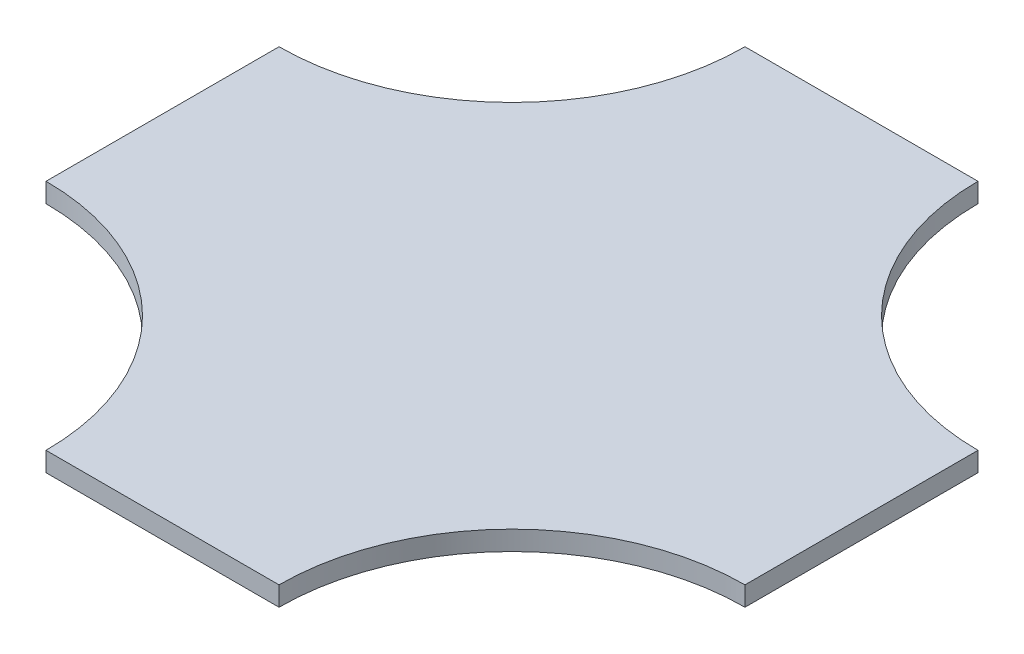
ISO-10303-21;
HEADER;
FILE_DESCRIPTION(('STEP AP214'),'2;1');
FILE_NAME('part.step','',(''),(''),'','','');
FILE_SCHEMA(('AUTOMOTIVE_DESIGN { 1 0 10303 214 1 1 1 1 }'));
ENDSEC;
DATA;
#1=APPLICATION_CONTEXT('core data for automotive mechanical design processes');
#2=APPLICATION_PROTOCOL_DEFINITION('international standard','automotive_design',2000,#1);
#3=PRODUCT_CONTEXT('',#1,'mechanical');
#4=PRODUCT('Part','Part','',(#3));
#5=PRODUCT_RELATED_PRODUCT_CATEGORY('part','',(#4));
#6=PRODUCT_DEFINITION_FORMATION('','',#4);
#7=PRODUCT_DEFINITION_CONTEXT('part definition',#1,'design');
#8=PRODUCT_DEFINITION('design','',#6,#7);
#9=PRODUCT_DEFINITION_SHAPE('','',#8);
#10=(LENGTH_UNIT() NAMED_UNIT(*) SI_UNIT(.MILLI.,.METRE.));
#11=(NAMED_UNIT(*) PLANE_ANGLE_UNIT() SI_UNIT($,.RADIAN.));
#12=(NAMED_UNIT(*) SI_UNIT($,.STERADIAN.) SOLID_ANGLE_UNIT());
#13=UNCERTAINTY_MEASURE_WITH_UNIT(LENGTH_MEASURE(1.E-05),#10,'distance_accuracy_value','');
#14=(GEOMETRIC_REPRESENTATION_CONTEXT(3) GLOBAL_UNCERTAINTY_ASSIGNED_CONTEXT((#13)) GLOBAL_UNIT_ASSIGNED_CONTEXT((#10,
#11,#12)) REPRESENTATION_CONTEXT('',''));
#15=CARTESIAN_POINT('',(0.,0.,0.));
#16=DIRECTION('',(0.,0.,1.));
#17=DIRECTION('',(1.,0.,0.));
#18=AXIS2_PLACEMENT_3D('',#15,#16,#17);
#19=CARTESIAN_POINT('',(0.,10.,180.));
#20=DIRECTION('',(0.,0.,1.));
#21=DIRECTION('',(1.,0.,0.));
#22=AXIS2_PLACEMENT_3D('',#19,#20,#21);
#23=PLANE('',#22);
#24=DIRECTION('',(-1.,0.,0.));
#25=VECTOR('',#24,1.);
#26=CARTESIAN_POINT('',(0.,0.,180.));
#27=LINE('',#26,#25);
#28=CARTESIAN_POINT('',(60.,0.,180.));
#29=VERTEX_POINT('',#28);
#30=CARTESIAN_POINT('',(-59.9999999999999,0.,180.));
#31=VERTEX_POINT('',#30);
#32=EDGE_CURVE('E127',#29,#31,#27,.T.);
#33=ORIENTED_EDGE('',*,*,#32,.F.);
#34=DIRECTION('',(0.,-1.,0.));
#35=VECTOR('',#34,1.);
#36=CARTESIAN_POINT('',(60.,10.,180.));
#37=LINE('',#36,#35);
#38=CARTESIAN_POINT('',(60.,10.,180.));
#39=VERTEX_POINT('',#38);
#40=EDGE_CURVE('E11',#39,#29,#37,.T.);
#41=ORIENTED_EDGE('',*,*,#40,.F.);
#42=DIRECTION('',(-1.,0.,0.));
#43=VECTOR('',#42,1.);
#44=CARTESIAN_POINT('',(0.,10.,180.));
#45=LINE('',#44,#43);
#46=CARTESIAN_POINT('',(-59.9999999999999,10.,180.));
#47=VERTEX_POINT('',#46);
#48=EDGE_CURVE('E145',#39,#47,#45,.T.);
#49=ORIENTED_EDGE('',*,*,#48,.T.);
#50=DIRECTION('',(0.,-1.,0.));
#51=VECTOR('',#50,1.);
#52=CARTESIAN_POINT('',(-59.9999999999999,10.,180.));
#53=LINE('',#52,#51);
#54=EDGE_CURVE('E85',#47,#31,#53,.T.);
#55=ORIENTED_EDGE('',*,*,#54,.T.);
#56=EDGE_LOOP('',(#33,#41,#49,#55));
#57=FACE_BOUND('',#56,.T.);
#58=ADVANCED_FACE('F34',(#57),#23,.T.);
#59=CARTESIAN_POINT('',(180.,10.,180.));
#60=DIRECTION('',(0.,-1.,0.));
#61=DIRECTION('',(0.,0.,-1.));
#62=AXIS2_PLACEMENT_3D('',#59,#60,#61);
#63=CYLINDRICAL_SURFACE('',#62,120.);
#64=CARTESIAN_POINT('',(180.,0.,180.));
#65=DIRECTION('',(0.,1.,0.));
#66=DIRECTION('',(0.,0.,1.));
#67=AXIS2_PLACEMENT_3D('',#64,#65,#66);
#68=CIRCLE('',#67,120.);
#69=CARTESIAN_POINT('',(180.,0.,60.0000000000001));
#70=VERTEX_POINT('',#69);
#71=EDGE_CURVE('E130',#70,#29,#68,.T.);
#72=ORIENTED_EDGE('',*,*,#71,.F.);
#73=DIRECTION('',(0.,-1.,0.));
#74=VECTOR('',#73,1.);
#75=CARTESIAN_POINT('',(180.,10.,60.0000000000001));
#76=LINE('',#75,#74);
#77=CARTESIAN_POINT('',(180.,10.,60.0000000000001));
#78=VERTEX_POINT('',#77);
#79=EDGE_CURVE('E42',#78,#70,#76,.T.);
#80=ORIENTED_EDGE('',*,*,#79,.F.);
#81=CARTESIAN_POINT('',(180.,10.,180.));
#82=DIRECTION('',(0.,1.,0.));
#83=DIRECTION('',(0.,0.,1.));
#84=AXIS2_PLACEMENT_3D('',#81,#82,#83);
#85=CIRCLE('',#84,120.);
#86=EDGE_CURVE('E171',#78,#39,#85,.T.);
#87=ORIENTED_EDGE('',*,*,#86,.T.);
#88=ORIENTED_EDGE('',*,*,#40,.T.);
#89=EDGE_LOOP('',(#72,#80,#87,#88));
#90=FACE_BOUND('',#89,.T.);
#91=ADVANCED_FACE('F162',(#90),#63,.F.);
#92=CARTESIAN_POINT('',(180.,10.,0.));
#93=DIRECTION('',(1.,0.,0.));
#94=DIRECTION('',(0.,0.,-1.));
#95=AXIS2_PLACEMENT_3D('',#92,#93,#94);
#96=PLANE('',#95);
#97=DIRECTION('',(0.,0.,1.));
#98=VECTOR('',#97,1.);
#99=CARTESIAN_POINT('',(180.,0.,0.));
#100=LINE('',#99,#98);
#101=CARTESIAN_POINT('',(180.,0.,-59.9999999999998));
#102=VERTEX_POINT('',#101);
#103=EDGE_CURVE('E133',#102,#70,#100,.T.);
#104=ORIENTED_EDGE('',*,*,#103,.F.);
#105=DIRECTION('',(0.,-1.,0.));
#106=VECTOR('',#105,1.);
#107=CARTESIAN_POINT('',(180.,10.,-59.9999999999998));
#108=LINE('',#107,#106);
#109=CARTESIAN_POINT('',(180.,10.,-59.9999999999998));
#110=VERTEX_POINT('',#109);
#111=EDGE_CURVE('E151',#110,#102,#108,.T.);
#112=ORIENTED_EDGE('',*,*,#111,.F.);
#113=DIRECTION('',(0.,0.,1.));
#114=VECTOR('',#113,1.);
#115=CARTESIAN_POINT('',(180.,10.,0.));
#116=LINE('',#115,#114);
#117=EDGE_CURVE('E158',#110,#78,#116,.T.);
#118=ORIENTED_EDGE('',*,*,#117,.T.);
#119=ORIENTED_EDGE('',*,*,#79,.T.);
#120=EDGE_LOOP('',(#104,#112,#118,#119));
#121=FACE_BOUND('',#120,.T.);
#122=ADVANCED_FACE('F156',(#121),#96,.T.);
#123=CARTESIAN_POINT('',(180.,10.,-180.));
#124=DIRECTION('',(0.,-1.,0.));
#125=DIRECTION('',(0.,0.,-1.));
#126=AXIS2_PLACEMENT_3D('',#123,#124,#125);
#127=CYLINDRICAL_SURFACE('',#126,120.);
#128=CARTESIAN_POINT('',(180.,0.,-180.));
#129=DIRECTION('',(0.,1.,0.));
#130=DIRECTION('',(0.,0.,1.));
#131=AXIS2_PLACEMENT_3D('',#128,#129,#130);
#132=CIRCLE('',#131,120.);
#133=CARTESIAN_POINT('',(60.,0.,-180.));
#134=VERTEX_POINT('',#133);
#135=EDGE_CURVE('E136',#134,#102,#132,.T.);
#136=ORIENTED_EDGE('',*,*,#135,.F.);
#137=DIRECTION('',(0.,-1.,0.));
#138=VECTOR('',#137,1.);
#139=CARTESIAN_POINT('',(60.,10.,-180.));
#140=LINE('',#139,#138);
#141=CARTESIAN_POINT('',(60.,10.,-180.));
#142=VERTEX_POINT('',#141);
#143=EDGE_CURVE('E149',#142,#134,#140,.T.);
#144=ORIENTED_EDGE('',*,*,#143,.F.);
#145=CARTESIAN_POINT('',(180.,10.,-180.));
#146=DIRECTION('',(0.,1.,0.));
#147=DIRECTION('',(0.,0.,1.));
#148=AXIS2_PLACEMENT_3D('',#145,#146,#147);
#149=CIRCLE('',#148,120.);
#150=EDGE_CURVE('E170',#142,#110,#149,.T.);
#151=ORIENTED_EDGE('',*,*,#150,.T.);
#152=ORIENTED_EDGE('',*,*,#111,.T.);
#153=EDGE_LOOP('',(#136,#144,#151,#152));
#154=FACE_BOUND('',#153,.T.);
#155=ADVANCED_FACE('F168',(#154),#127,.F.);
#156=CARTESIAN_POINT('',(0.,10.,-180.));
#157=DIRECTION('',(0.,0.,1.));
#158=DIRECTION('',(1.,0.,0.));
#159=AXIS2_PLACEMENT_3D('',#156,#157,#158);
#160=PLANE('',#159);
#161=DIRECTION('',(-1.,0.,0.));
#162=VECTOR('',#161,1.);
#163=CARTESIAN_POINT('',(0.,0.,-180.));
#164=LINE('',#163,#162);
#165=CARTESIAN_POINT('',(-59.9999999999999,0.,-180.));
#166=VERTEX_POINT('',#165);
#167=EDGE_CURVE('E139',#134,#166,#164,.T.);
#168=ORIENTED_EDGE('',*,*,#167,.T.);
#169=DIRECTION('',(0.,-1.,0.));
#170=VECTOR('',#169,1.);
#171=CARTESIAN_POINT('',(-59.9999999999999,10.,-180.));
#172=LINE('',#171,#170);
#173=CARTESIAN_POINT('',(-59.9999999999999,10.,-180.));
#174=VERTEX_POINT('',#173);
#175=EDGE_CURVE('E119',#174,#166,#172,.T.);
#176=ORIENTED_EDGE('',*,*,#175,.F.);
#177=DIRECTION('',(-1.,0.,0.));
#178=VECTOR('',#177,1.);
#179=CARTESIAN_POINT('',(0.,10.,-180.));
#180=LINE('',#179,#178);
#181=EDGE_CURVE('E110',#142,#174,#180,.T.);
#182=ORIENTED_EDGE('',*,*,#181,.F.);
#183=ORIENTED_EDGE('',*,*,#143,.T.);
#184=EDGE_LOOP('',(#168,#176,#182,#183));
#185=FACE_BOUND('',#184,.T.);
#186=ADVANCED_FACE('F187',(#185),#160,.F.);
#187=CARTESIAN_POINT('',(-180.,10.,-180.));
#188=DIRECTION('',(0.,-1.,0.));
#189=DIRECTION('',(0.,0.,-1.));
#190=AXIS2_PLACEMENT_3D('',#187,#188,#189);
#191=CYLINDRICAL_SURFACE('',#190,120.);
#192=CARTESIAN_POINT('',(-180.,0.,-180.));
#193=DIRECTION('',(0.,1.,0.));
#194=DIRECTION('',(0.,0.,1.));
#195=AXIS2_PLACEMENT_3D('',#192,#193,#194);
#196=CIRCLE('',#195,120.);
#197=CARTESIAN_POINT('',(-180.,0.,-59.9999999999998));
#198=VERTEX_POINT('',#197);
#199=EDGE_CURVE('E118',#166,#198,#196,.F.);
#200=ORIENTED_EDGE('',*,*,#199,.T.);
#201=DIRECTION('',(0.,-1.,0.));
#202=VECTOR('',#201,1.);
#203=CARTESIAN_POINT('',(-180.,10.,-59.9999999999998));
#204=LINE('',#203,#202);
#205=CARTESIAN_POINT('',(-180.,10.,-59.9999999999998));
#206=VERTEX_POINT('',#205);
#207=EDGE_CURVE('E115',#206,#198,#204,.T.);
#208=ORIENTED_EDGE('',*,*,#207,.F.);
#209=CARTESIAN_POINT('',(-180.,10.,-180.));
#210=DIRECTION('',(0.,1.,0.));
#211=DIRECTION('',(0.,0.,1.));
#212=AXIS2_PLACEMENT_3D('',#209,#210,#211);
#213=CIRCLE('',#212,120.);
#214=EDGE_CURVE('E103',#174,#206,#213,.F.);
#215=ORIENTED_EDGE('',*,*,#214,.F.);
#216=ORIENTED_EDGE('',*,*,#175,.T.);
#217=EDGE_LOOP('',(#200,#208,#215,#216));
#218=FACE_BOUND('',#217,.T.);
#219=ADVANCED_FACE('F116',(#218),#191,.F.);
#220=CARTESIAN_POINT('',(-180.,10.,0.));
#221=DIRECTION('',(1.,0.,0.));
#222=DIRECTION('',(0.,0.,-1.));
#223=AXIS2_PLACEMENT_3D('',#220,#221,#222);
#224=PLANE('',#223);
#225=DIRECTION('',(0.,0.,1.));
#226=VECTOR('',#225,1.);
#227=CARTESIAN_POINT('',(-180.,0.,0.));
#228=LINE('',#227,#226);
#229=CARTESIAN_POINT('',(-180.,0.,60.0000000000001));
#230=VERTEX_POINT('',#229);
#231=EDGE_CURVE('E78',#198,#230,#228,.T.);
#232=ORIENTED_EDGE('',*,*,#231,.T.);
#233=DIRECTION('',(0.,-1.,0.));
#234=VECTOR('',#233,1.);
#235=CARTESIAN_POINT('',(-180.,10.,60.0000000000001));
#236=LINE('',#235,#234);
#237=CARTESIAN_POINT('',(-180.,10.,60.0000000000001));
#238=VERTEX_POINT('',#237);
#239=EDGE_CURVE('E120',#238,#230,#236,.T.);
#240=ORIENTED_EDGE('',*,*,#239,.F.);
#241=DIRECTION('',(0.,0.,1.));
#242=VECTOR('',#241,1.);
#243=CARTESIAN_POINT('',(-180.,10.,0.));
#244=LINE('',#243,#242);
#245=EDGE_CURVE('E107',#206,#238,#244,.T.);
#246=ORIENTED_EDGE('',*,*,#245,.F.);
#247=ORIENTED_EDGE('',*,*,#207,.T.);
#248=EDGE_LOOP('',(#232,#240,#246,#247));
#249=FACE_BOUND('',#248,.T.);
#250=ADVANCED_FACE('F122',(#249),#224,.F.);
#251=CARTESIAN_POINT('',(-180.,10.,180.));
#252=DIRECTION('',(0.,-1.,0.));
#253=DIRECTION('',(0.,0.,-1.));
#254=AXIS2_PLACEMENT_3D('',#251,#252,#253);
#255=CYLINDRICAL_SURFACE('',#254,120.);
#256=CARTESIAN_POINT('',(-180.,0.,180.));
#257=DIRECTION('',(0.,1.,0.));
#258=DIRECTION('',(0.,0.,1.));
#259=AXIS2_PLACEMENT_3D('',#256,#257,#258);
#260=CIRCLE('',#259,120.);
#261=EDGE_CURVE('E143',#230,#31,#260,.F.);
#262=ORIENTED_EDGE('',*,*,#261,.T.);
#263=ORIENTED_EDGE('',*,*,#54,.F.);
#264=CARTESIAN_POINT('',(-180.,10.,180.));
#265=DIRECTION('',(0.,1.,0.));
#266=DIRECTION('',(0.,0.,1.));
#267=AXIS2_PLACEMENT_3D('',#264,#265,#266);
#268=CIRCLE('',#267,120.);
#269=EDGE_CURVE('E50',#238,#47,#268,.F.);
#270=ORIENTED_EDGE('',*,*,#269,.F.);
#271=ORIENTED_EDGE('',*,*,#239,.T.);
#272=EDGE_LOOP('',(#262,#263,#270,#271));
#273=FACE_BOUND('',#272,.T.);
#274=ADVANCED_FACE('F195',(#273),#255,.F.);
#275=CARTESIAN_POINT('',(0.,10.,0.));
#276=DIRECTION('',(0.,1.,0.));
#277=DIRECTION('',(0.,0.,1.));
#278=AXIS2_PLACEMENT_3D('',#275,#276,#277);
#279=PLANE('',#278);
#280=ORIENTED_EDGE('',*,*,#48,.F.);
#281=ORIENTED_EDGE('',*,*,#86,.F.);
#282=ORIENTED_EDGE('',*,*,#117,.F.);
#283=ORIENTED_EDGE('',*,*,#150,.F.);
#284=ORIENTED_EDGE('',*,*,#181,.T.);
#285=ORIENTED_EDGE('',*,*,#214,.T.);
#286=ORIENTED_EDGE('',*,*,#245,.T.);
#287=ORIENTED_EDGE('',*,*,#269,.T.);
#288=EDGE_LOOP('',(#280,#281,#282,#283,#284,#285,#286,#287));
#289=FACE_BOUND('',#288,.T.);
#290=ADVANCED_FACE('F105',(#289),#279,.T.);
#291=CARTESIAN_POINT('',(0.,0.,0.));
#292=DIRECTION('',(0.,1.,0.));
#293=DIRECTION('',(0.,0.,1.));
#294=AXIS2_PLACEMENT_3D('',#291,#292,#293);
#295=PLANE('',#294);
#296=ORIENTED_EDGE('',*,*,#32,.T.);
#297=ORIENTED_EDGE('',*,*,#261,.F.);
#298=ORIENTED_EDGE('',*,*,#231,.F.);
#299=ORIENTED_EDGE('',*,*,#199,.F.);
#300=ORIENTED_EDGE('',*,*,#167,.F.);
#301=ORIENTED_EDGE('',*,*,#135,.T.);
#302=ORIENTED_EDGE('',*,*,#103,.T.);
#303=ORIENTED_EDGE('',*,*,#71,.T.);
#304=EDGE_LOOP('',(#296,#297,#298,#299,#300,#301,#302,#303));
#305=FACE_BOUND('',#304,.T.);
#306=ADVANCED_FACE('F164',(#305),#295,.F.);
#307=CLOSED_SHELL('',(#58,#91,#122,#155,#186,#219,#250,#274,#290,#306));
#308=MANIFOLD_SOLID_BREP('B2',#307);
#309=ADVANCED_BREP_SHAPE_REPRESENTATION('',(#18,#308),#14);
#310=SHAPE_DEFINITION_REPRESENTATION(#9,#309);
ENDSEC;
END-ISO-10303-21;
